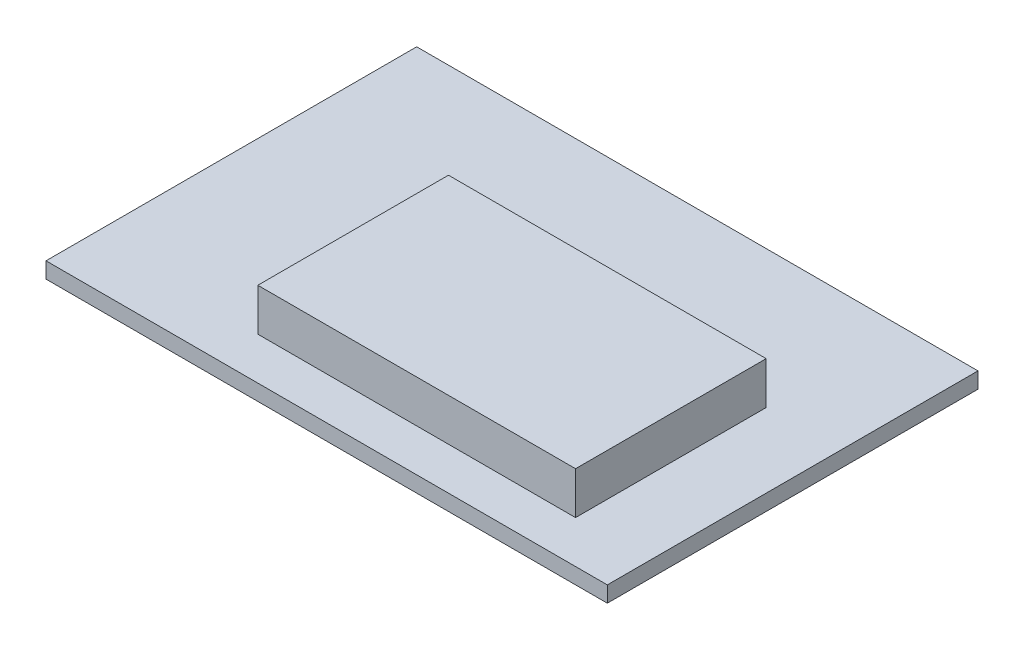
ISO-10303-21;
HEADER;
FILE_DESCRIPTION(('STEP AP214'),'2;1');
FILE_NAME('part.step','',(''),(''),'','','');
FILE_SCHEMA(('AUTOMOTIVE_DESIGN { 1 0 10303 214 1 1 1 1 }'));
ENDSEC;
DATA;
#1=APPLICATION_CONTEXT('core data for automotive mechanical design processes');
#2=APPLICATION_PROTOCOL_DEFINITION('international standard','automotive_design',2000,#1);
#3=PRODUCT_CONTEXT('',#1,'mechanical');
#4=PRODUCT('Part','Part','',(#3));
#5=PRODUCT_RELATED_PRODUCT_CATEGORY('part','',(#4));
#6=PRODUCT_DEFINITION_FORMATION('','',#4);
#7=PRODUCT_DEFINITION_CONTEXT('part definition',#1,'design');
#8=PRODUCT_DEFINITION('design','',#6,#7);
#9=PRODUCT_DEFINITION_SHAPE('','',#8);
#10=(LENGTH_UNIT() NAMED_UNIT(*) SI_UNIT(.MILLI.,.METRE.));
#11=(NAMED_UNIT(*) PLANE_ANGLE_UNIT() SI_UNIT($,.RADIAN.));
#12=(NAMED_UNIT(*) SI_UNIT($,.STERADIAN.) SOLID_ANGLE_UNIT());
#13=UNCERTAINTY_MEASURE_WITH_UNIT(LENGTH_MEASURE(1.E-05),#10,'distance_accuracy_value','');
#14=(GEOMETRIC_REPRESENTATION_CONTEXT(3) GLOBAL_UNCERTAINTY_ASSIGNED_CONTEXT((#13)) GLOBAL_UNIT_ASSIGNED_CONTEXT((#10,
#11,#12)) REPRESENTATION_CONTEXT('',''));
#15=CARTESIAN_POINT('',(0.,0.,0.));
#16=DIRECTION('',(0.,0.,1.));
#17=DIRECTION('',(1.,0.,0.));
#18=AXIS2_PLACEMENT_3D('',#15,#16,#17);
#19=CARTESIAN_POINT('',(0.,1.5,0.));
#20=DIRECTION('',(0.,1.,0.));
#21=DIRECTION('',(0.,0.,1.));
#22=AXIS2_PLACEMENT_3D('',#19,#20,#21);
#23=PLANE('',#22);
#24=DIRECTION('',(0.,0.,1.));
#25=VECTOR('',#24,1.);
#26=CARTESIAN_POINT('',(-28.7306223829687,1.5,-15.5259127106183));
#27=LINE('',#26,#25);
#28=CARTESIAN_POINT('',(-28.7306223829687,1.5,-15.5259127106183));
#29=VERTEX_POINT('',#28);
#30=CARTESIAN_POINT('',(-28.7306223829687,1.5,19.4740872893817));
#31=VERTEX_POINT('',#30);
#32=EDGE_CURVE('E144',#29,#31,#27,.T.);
#33=ORIENTED_EDGE('',*,*,#32,.T.);
#34=DIRECTION('',(1.,0.,0.));
#35=VECTOR('',#34,1.);
#36=CARTESIAN_POINT('',(-28.7306223829687,1.5,19.4740872893817));
#37=LINE('',#36,#35);
#38=CARTESIAN_POINT('',(24.2693776170313,1.5,19.4740872893817));
#39=VERTEX_POINT('',#38);
#40=EDGE_CURVE('E89',#31,#39,#37,.T.);
#41=ORIENTED_EDGE('',*,*,#40,.T.);
#42=DIRECTION('',(0.,0.,-1.));
#43=VECTOR('',#42,1.);
#44=CARTESIAN_POINT('',(24.2693776170313,1.5,-15.5259127106183));
#45=LINE('',#44,#43);
#46=CARTESIAN_POINT('',(24.2693776170313,1.5,-15.5259127106183));
#47=VERTEX_POINT('',#46);
#48=EDGE_CURVE('E147',#39,#47,#45,.T.);
#49=ORIENTED_EDGE('',*,*,#48,.T.);
#50=DIRECTION('',(-1.,0.,0.));
#51=VECTOR('',#50,1.);
#52=CARTESIAN_POINT('',(-28.7306223829687,1.5,-15.5259127106183));
#53=LINE('',#52,#51);
#54=EDGE_CURVE('E61',#47,#29,#53,.T.);
#55=ORIENTED_EDGE('',*,*,#54,.T.);
#56=EDGE_LOOP('',(#33,#41,#49,#55));
#57=FACE_BOUND('',#56,.T.);
#58=DIRECTION('',(1.,0.,0.));
#59=VECTOR('',#58,1.);
#60=CARTESIAN_POINT('',(-12.7306223829687,1.5,15.4740872893817));
#61=LINE('',#60,#59);
#62=CARTESIAN_POINT('',(-12.7306223829687,1.5,15.4740872893817));
#63=VERTEX_POINT('',#62);
#64=CARTESIAN_POINT('',(17.2693776170313,1.5,15.4740872893817));
#65=VERTEX_POINT('',#64);
#66=EDGE_CURVE('E267',#63,#65,#61,.T.);
#67=ORIENTED_EDGE('',*,*,#66,.F.);
#68=DIRECTION('',(0.,0.,1.));
#69=VECTOR('',#68,1.);
#70=CARTESIAN_POINT('',(-12.7306223829687,1.5,-2.52591271061828));
#71=LINE('',#70,#69);
#72=CARTESIAN_POINT('',(-12.7306223829687,1.5,-2.52591271061828));
#73=VERTEX_POINT('',#72);
#74=EDGE_CURVE('E134',#73,#63,#71,.T.);
#75=ORIENTED_EDGE('',*,*,#74,.F.);
#76=DIRECTION('',(-1.,0.,0.));
#77=VECTOR('',#76,1.);
#78=CARTESIAN_POINT('',(-12.7306223829687,1.5,-2.52591271061828));
#79=LINE('',#78,#77);
#80=CARTESIAN_POINT('',(17.2693776170313,1.5,-2.52591271061828));
#81=VERTEX_POINT('',#80);
#82=EDGE_CURVE('E130',#81,#73,#79,.T.);
#83=ORIENTED_EDGE('',*,*,#82,.F.);
#84=DIRECTION('',(0.,0.,-1.));
#85=VECTOR('',#84,1.);
#86=CARTESIAN_POINT('',(17.2693776170313,1.5,-2.52591271061828));
#87=LINE('',#86,#85);
#88=EDGE_CURVE('E264',#65,#81,#87,.T.);
#89=ORIENTED_EDGE('',*,*,#88,.F.);
#90=EDGE_LOOP('',(#67,#75,#83,#89));
#91=FACE_BOUND('',#90,.T.);
#92=ADVANCED_FACE('F37',(#57,#91),#23,.T.);
#93=CARTESIAN_POINT('',(-28.7306223829687,1.5,-15.5259127106183));
#94=DIRECTION('',(1.,0.,0.));
#95=DIRECTION('',(0.,0.,-1.));
#96=AXIS2_PLACEMENT_3D('',#93,#94,#95);
#97=PLANE('',#96);
#98=DIRECTION('',(0.,0.,1.));
#99=VECTOR('',#98,1.);
#100=CARTESIAN_POINT('',(-28.7306223829687,0.,-15.5259127106183));
#101=LINE('',#100,#99);
#102=CARTESIAN_POINT('',(-28.7306223829687,0.,-15.5259127106183));
#103=VERTEX_POINT('',#102);
#104=CARTESIAN_POINT('',(-28.7306223829687,0.,19.4740872893817));
#105=VERTEX_POINT('',#104);
#106=EDGE_CURVE('E136',#103,#105,#101,.T.);
#107=ORIENTED_EDGE('',*,*,#106,.T.);
#108=DIRECTION('',(0.,-1.,0.));
#109=VECTOR('',#108,1.);
#110=CARTESIAN_POINT('',(-28.7306223829687,1.5,19.4740872893817));
#111=LINE('',#110,#109);
#112=EDGE_CURVE('E11',#31,#105,#111,.T.);
#113=ORIENTED_EDGE('',*,*,#112,.F.);
#114=ORIENTED_EDGE('',*,*,#32,.F.);
#115=DIRECTION('',(0.,-1.,0.));
#116=VECTOR('',#115,1.);
#117=CARTESIAN_POINT('',(-28.7306223829687,1.5,-15.5259127106183));
#118=LINE('',#117,#116);
#119=EDGE_CURVE('E149',#29,#103,#118,.T.);
#120=ORIENTED_EDGE('',*,*,#119,.T.);
#121=EDGE_LOOP('',(#107,#113,#114,#120));
#122=FACE_BOUND('',#121,.T.);
#123=ADVANCED_FACE('F39',(#122),#97,.F.);
#124=CARTESIAN_POINT('',(-28.7306223829687,1.5,19.4740872893817));
#125=DIRECTION('',(0.,0.,-1.));
#126=DIRECTION('',(-1.,0.,0.));
#127=AXIS2_PLACEMENT_3D('',#124,#125,#126);
#128=PLANE('',#127);
#129=DIRECTION('',(1.,0.,0.));
#130=VECTOR('',#129,1.);
#131=CARTESIAN_POINT('',(-28.7306223829687,0.,19.4740872893817));
#132=LINE('',#131,#130);
#133=CARTESIAN_POINT('',(24.2693776170313,0.,19.4740872893817));
#134=VERTEX_POINT('',#133);
#135=EDGE_CURVE('E139',#105,#134,#132,.T.);
#136=ORIENTED_EDGE('',*,*,#135,.T.);
#137=DIRECTION('',(0.,-1.,0.));
#138=VECTOR('',#137,1.);
#139=CARTESIAN_POINT('',(24.2693776170313,1.5,19.4740872893817));
#140=LINE('',#139,#138);
#141=EDGE_CURVE('E45',#39,#134,#140,.T.);
#142=ORIENTED_EDGE('',*,*,#141,.F.);
#143=ORIENTED_EDGE('',*,*,#40,.F.);
#144=ORIENTED_EDGE('',*,*,#112,.T.);
#145=EDGE_LOOP('',(#136,#142,#143,#144));
#146=FACE_BOUND('',#145,.T.);
#147=ADVANCED_FACE('F177',(#146),#128,.F.);
#148=CARTESIAN_POINT('',(24.2693776170313,1.5,-15.5259127106183));
#149=DIRECTION('',(-1.,0.,0.));
#150=DIRECTION('',(0.,0.,1.));
#151=AXIS2_PLACEMENT_3D('',#148,#149,#150);
#152=PLANE('',#151);
#153=DIRECTION('',(0.,0.,-1.));
#154=VECTOR('',#153,1.);
#155=CARTESIAN_POINT('',(24.2693776170313,0.,-15.5259127106183));
#156=LINE('',#155,#154);
#157=CARTESIAN_POINT('',(24.2693776170313,0.,-15.5259127106183));
#158=VERTEX_POINT('',#157);
#159=EDGE_CURVE('E152',#134,#158,#156,.T.);
#160=ORIENTED_EDGE('',*,*,#159,.T.);
#161=DIRECTION('',(0.,-1.,0.));
#162=VECTOR('',#161,1.);
#163=CARTESIAN_POINT('',(24.2693776170313,1.5,-15.5259127106183));
#164=LINE('',#163,#162);
#165=EDGE_CURVE('E156',#47,#158,#164,.T.);
#166=ORIENTED_EDGE('',*,*,#165,.F.);
#167=ORIENTED_EDGE('',*,*,#48,.F.);
#168=ORIENTED_EDGE('',*,*,#141,.T.);
#169=EDGE_LOOP('',(#160,#166,#167,#168));
#170=FACE_BOUND('',#169,.T.);
#171=ADVANCED_FACE('F161',(#170),#152,.F.);
#172=CARTESIAN_POINT('',(-28.7306223829687,1.5,-15.5259127106183));
#173=DIRECTION('',(0.,0.,1.));
#174=DIRECTION('',(1.,0.,0.));
#175=AXIS2_PLACEMENT_3D('',#172,#173,#174);
#176=PLANE('',#175);
#177=DIRECTION('',(-1.,0.,0.));
#178=VECTOR('',#177,1.);
#179=CARTESIAN_POINT('',(-28.7306223829687,0.,-15.5259127106183));
#180=LINE('',#179,#178);
#181=EDGE_CURVE('E82',#158,#103,#180,.T.);
#182=ORIENTED_EDGE('',*,*,#181,.T.);
#183=ORIENTED_EDGE('',*,*,#119,.F.);
#184=ORIENTED_EDGE('',*,*,#54,.F.);
#185=ORIENTED_EDGE('',*,*,#165,.T.);
#186=EDGE_LOOP('',(#182,#183,#184,#185));
#187=FACE_BOUND('',#186,.T.);
#188=ADVANCED_FACE('F169',(#187),#176,.F.);
#189=CARTESIAN_POINT('',(0.,0.,0.));
#190=DIRECTION('',(0.,1.,0.));
#191=DIRECTION('',(0.,0.,1.));
#192=AXIS2_PLACEMENT_3D('',#189,#190,#191);
#193=PLANE('',#192);
#194=ORIENTED_EDGE('',*,*,#106,.F.);
#195=ORIENTED_EDGE('',*,*,#181,.F.);
#196=ORIENTED_EDGE('',*,*,#159,.F.);
#197=ORIENTED_EDGE('',*,*,#135,.F.);
#198=EDGE_LOOP('',(#194,#195,#196,#197));
#199=FACE_BOUND('',#198,.T.);
#200=ADVANCED_FACE('F165',(#199),#193,.F.);
#201=CARTESIAN_POINT('',(-12.7306223829687,5.5,-2.52591271061828));
#202=DIRECTION('',(1.,0.,0.));
#203=DIRECTION('',(0.,0.,-1.));
#204=AXIS2_PLACEMENT_3D('',#201,#202,#203);
#205=PLANE('',#204);
#206=ORIENTED_EDGE('',*,*,#74,.T.);
#207=DIRECTION('',(0.,-1.,0.));
#208=VECTOR('',#207,1.);
#209=CARTESIAN_POINT('',(-12.7306223829687,5.5,15.4740872893817));
#210=LINE('',#209,#208);
#211=CARTESIAN_POINT('',(-12.7306223829687,5.5,15.4740872893817));
#212=VERTEX_POINT('',#211);
#213=EDGE_CURVE('E115',#212,#63,#210,.T.);
#214=ORIENTED_EDGE('',*,*,#213,.F.);
#215=DIRECTION('',(0.,0.,1.));
#216=VECTOR('',#215,1.);
#217=CARTESIAN_POINT('',(-12.7306223829687,5.5,-2.52591271061828));
#218=LINE('',#217,#216);
#219=CARTESIAN_POINT('',(-12.7306223829687,5.5,-2.52591271061828));
#220=VERTEX_POINT('',#219);
#221=EDGE_CURVE('E122',#220,#212,#218,.T.);
#222=ORIENTED_EDGE('',*,*,#221,.F.);
#223=DIRECTION('',(0.,-1.,0.));
#224=VECTOR('',#223,1.);
#225=CARTESIAN_POINT('',(-12.7306223829687,5.5,-2.52591271061828));
#226=LINE('',#225,#224);
#227=EDGE_CURVE('E262',#220,#73,#226,.T.);
#228=ORIENTED_EDGE('',*,*,#227,.T.);
#229=EDGE_LOOP('',(#206,#214,#222,#228));
#230=FACE_BOUND('',#229,.T.);
#231=ADVANCED_FACE('F132',(#230),#205,.F.);
#232=CARTESIAN_POINT('',(-12.7306223829687,5.5,15.4740872893817));
#233=DIRECTION('',(0.,0.,-1.));
#234=DIRECTION('',(-1.,0.,0.));
#235=AXIS2_PLACEMENT_3D('',#232,#233,#234);
#236=PLANE('',#235);
#237=ORIENTED_EDGE('',*,*,#66,.T.);
#238=DIRECTION('',(0.,-1.,0.));
#239=VECTOR('',#238,1.);
#240=CARTESIAN_POINT('',(17.2693776170313,5.5,15.4740872893817));
#241=LINE('',#240,#239);
#242=CARTESIAN_POINT('',(17.2693776170313,5.5,15.4740872893817));
#243=VERTEX_POINT('',#242);
#244=EDGE_CURVE('E118',#243,#65,#241,.T.);
#245=ORIENTED_EDGE('',*,*,#244,.F.);
#246=DIRECTION('',(1.,0.,0.));
#247=VECTOR('',#246,1.);
#248=CARTESIAN_POINT('',(-12.7306223829687,5.5,15.4740872893817));
#249=LINE('',#248,#247);
#250=EDGE_CURVE('E111',#212,#243,#249,.T.);
#251=ORIENTED_EDGE('',*,*,#250,.F.);
#252=ORIENTED_EDGE('',*,*,#213,.T.);
#253=EDGE_LOOP('',(#237,#245,#251,#252));
#254=FACE_BOUND('',#253,.T.);
#255=ADVANCED_FACE('F113',(#254),#236,.F.);
#256=CARTESIAN_POINT('',(17.2693776170313,5.5,-2.52591271061828));
#257=DIRECTION('',(-1.,0.,0.));
#258=DIRECTION('',(0.,0.,1.));
#259=AXIS2_PLACEMENT_3D('',#256,#257,#258);
#260=PLANE('',#259);
#261=ORIENTED_EDGE('',*,*,#88,.T.);
#262=DIRECTION('',(0.,-1.,0.));
#263=VECTOR('',#262,1.);
#264=CARTESIAN_POINT('',(17.2693776170313,5.5,-2.52591271061828));
#265=LINE('',#264,#263);
#266=CARTESIAN_POINT('',(17.2693776170313,5.5,-2.52591271061828));
#267=VERTEX_POINT('',#266);
#268=EDGE_CURVE('E52',#267,#81,#265,.T.);
#269=ORIENTED_EDGE('',*,*,#268,.F.);
#270=DIRECTION('',(0.,0.,-1.));
#271=VECTOR('',#270,1.);
#272=CARTESIAN_POINT('',(17.2693776170313,5.5,-2.52591271061828));
#273=LINE('',#272,#271);
#274=EDGE_CURVE('E121',#243,#267,#273,.T.);
#275=ORIENTED_EDGE('',*,*,#274,.F.);
#276=ORIENTED_EDGE('',*,*,#244,.T.);
#277=EDGE_LOOP('',(#261,#269,#275,#276));
#278=FACE_BOUND('',#277,.T.);
#279=ADVANCED_FACE('F190',(#278),#260,.F.);
#280=CARTESIAN_POINT('',(-12.7306223829687,5.5,-2.52591271061828));
#281=DIRECTION('',(0.,0.,1.));
#282=DIRECTION('',(1.,0.,0.));
#283=AXIS2_PLACEMENT_3D('',#280,#281,#282);
#284=PLANE('',#283);
#285=ORIENTED_EDGE('',*,*,#82,.T.);
#286=ORIENTED_EDGE('',*,*,#227,.F.);
#287=DIRECTION('',(-1.,0.,0.));
#288=VECTOR('',#287,1.);
#289=CARTESIAN_POINT('',(-12.7306223829687,5.5,-2.52591271061828));
#290=LINE('',#289,#288);
#291=EDGE_CURVE('E126',#267,#220,#290,.T.);
#292=ORIENTED_EDGE('',*,*,#291,.F.);
#293=ORIENTED_EDGE('',*,*,#268,.T.);
#294=EDGE_LOOP('',(#285,#286,#292,#293));
#295=FACE_BOUND('',#294,.T.);
#296=ADVANCED_FACE('F193',(#295),#284,.F.);
#297=CARTESIAN_POINT('',(0.,5.5,0.));
#298=DIRECTION('',(0.,1.,0.));
#299=DIRECTION('',(0.,0.,1.));
#300=AXIS2_PLACEMENT_3D('',#297,#298,#299);
#301=PLANE('',#300);
#302=ORIENTED_EDGE('',*,*,#221,.T.);
#303=ORIENTED_EDGE('',*,*,#250,.T.);
#304=ORIENTED_EDGE('',*,*,#274,.T.);
#305=ORIENTED_EDGE('',*,*,#291,.T.);
#306=EDGE_LOOP('',(#302,#303,#304,#305));
#307=FACE_BOUND('',#306,.T.);
#308=ADVANCED_FACE('F125',(#307),#301,.T.);
#309=CLOSED_SHELL('',(#92,#123,#147,#171,#188,#200,#231,#255,#279,#296,#308));
#310=MANIFOLD_SOLID_BREP('B2',#309);
#311=ADVANCED_BREP_SHAPE_REPRESENTATION('',(#18,#310),#14);
#312=SHAPE_DEFINITION_REPRESENTATION(#9,#311);
ENDSEC;
END-ISO-10303-21;
